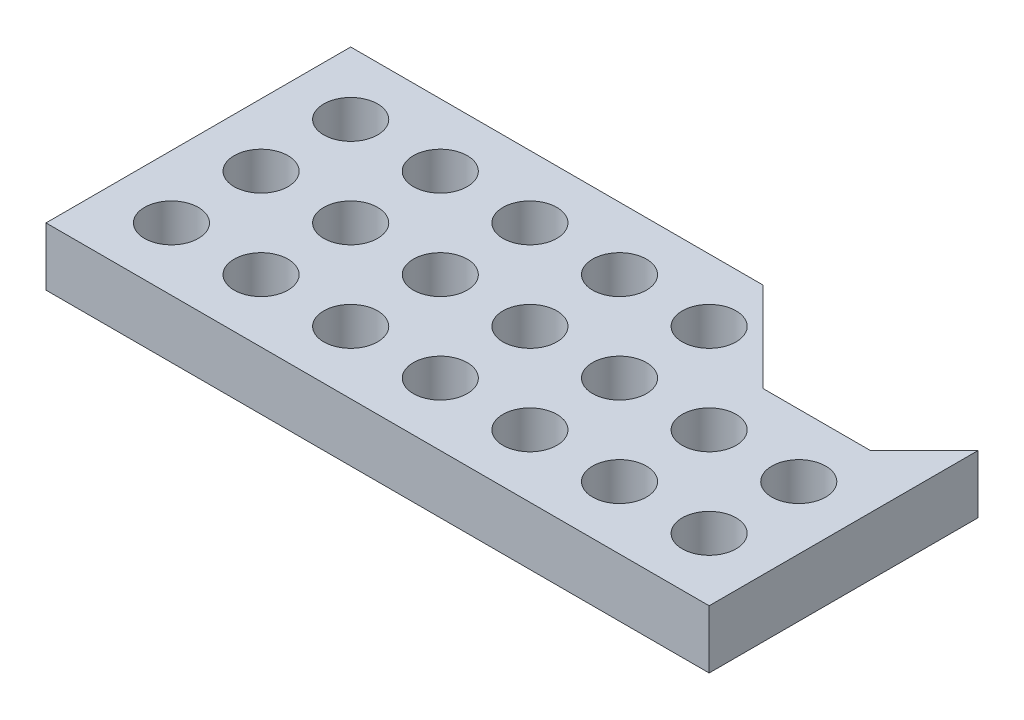
ISO-10303-21;
HEADER;
FILE_DESCRIPTION(('STEP AP214'),'2;1');
FILE_NAME('part.step','',(''),(''),'','','');
FILE_SCHEMA(('AUTOMOTIVE_DESIGN { 1 0 10303 214 1 1 1 1 }'));
ENDSEC;
DATA;
#1=APPLICATION_CONTEXT('core data for automotive mechanical design processes');
#2=APPLICATION_PROTOCOL_DEFINITION('international standard','automotive_design',2000,#1);
#3=PRODUCT_CONTEXT('',#1,'mechanical');
#4=PRODUCT('Part','Part','',(#3));
#5=PRODUCT_RELATED_PRODUCT_CATEGORY('part','',(#4));
#6=PRODUCT_DEFINITION_FORMATION('','',#4);
#7=PRODUCT_DEFINITION_CONTEXT('part definition',#1,'design');
#8=PRODUCT_DEFINITION('design','',#6,#7);
#9=PRODUCT_DEFINITION_SHAPE('','',#8);
#10=(LENGTH_UNIT() NAMED_UNIT(*) SI_UNIT(.MILLI.,.METRE.));
#11=(NAMED_UNIT(*) PLANE_ANGLE_UNIT() SI_UNIT($,.RADIAN.));
#12=(NAMED_UNIT(*) SI_UNIT($,.STERADIAN.) SOLID_ANGLE_UNIT());
#13=UNCERTAINTY_MEASURE_WITH_UNIT(LENGTH_MEASURE(1.E-05),#10,'distance_accuracy_value','');
#14=(GEOMETRIC_REPRESENTATION_CONTEXT(3) GLOBAL_UNCERTAINTY_ASSIGNED_CONTEXT((#13)) GLOBAL_UNIT_ASSIGNED_CONTEXT((#10,
#11,#12)) REPRESENTATION_CONTEXT('',''));
#15=CARTESIAN_POINT('',(0.,0.,0.));
#16=DIRECTION('',(0.,0.,1.));
#17=DIRECTION('',(1.,0.,0.));
#18=AXIS2_PLACEMENT_3D('',#15,#16,#17);
#19=CARTESIAN_POINT('',(0.,3.25,0.));
#20=DIRECTION('',(0.,1.,0.));
#21=DIRECTION('',(0.,0.,1.));
#22=AXIS2_PLACEMENT_3D('',#19,#20,#21);
#23=PLANE('',#22);
#24=CARTESIAN_POINT('',(-15.,3.25,0.));
#25=DIRECTION('',(0.,1.,0.));
#26=DIRECTION('',(0.,0.,1.));
#27=AXIS2_PLACEMENT_3D('',#24,#25,#26);
#28=CIRCLE('',#27,1.5025);
#29=CARTESIAN_POINT('',(-15.,3.25,1.50250000000001));
#30=VERTEX_POINT('',#29);
#31=EDGE_CURVE('E261',#30,#30,#28,.T.);
#32=ORIENTED_EDGE('',*,*,#31,.F.);
#33=EDGE_LOOP('',(#32));
#34=FACE_BOUND('',#33,.T.);
#35=CARTESIAN_POINT('',(0.,3.25,-4.99999999999999));
#36=DIRECTION('',(0.,1.,0.));
#37=DIRECTION('',(0.,0.,1.));
#38=AXIS2_PLACEMENT_3D('',#35,#36,#37);
#39=CIRCLE('',#38,1.5025);
#40=CARTESIAN_POINT('',(0.,3.25,-3.49749999999999));
#41=VERTEX_POINT('',#40);
#42=EDGE_CURVE('E249',#41,#41,#39,.T.);
#43=ORIENTED_EDGE('',*,*,#42,.F.);
#44=EDGE_LOOP('',(#43));
#45=FACE_BOUND('',#44,.T.);
#46=CARTESIAN_POINT('',(-10.,3.25,-4.99999999999999));
#47=DIRECTION('',(0.,1.,0.));
#48=DIRECTION('',(0.,0.,1.));
#49=AXIS2_PLACEMENT_3D('',#46,#47,#48);
#50=CIRCLE('',#49,1.5025);
#51=CARTESIAN_POINT('',(-10.,3.25,-3.49749999999999));
#52=VERTEX_POINT('',#51);
#53=EDGE_CURVE('E237',#52,#52,#50,.T.);
#54=ORIENTED_EDGE('',*,*,#53,.F.);
#55=EDGE_LOOP('',(#54));
#56=FACE_BOUND('',#55,.T.);
#57=CARTESIAN_POINT('',(9.99999999999999,3.25,0.));
#58=DIRECTION('',(0.,1.,0.));
#59=DIRECTION('',(0.,0.,1.));
#60=AXIS2_PLACEMENT_3D('',#57,#58,#59);
#61=CIRCLE('',#60,1.5025);
#62=CARTESIAN_POINT('',(9.99999999999999,3.25,1.50250000000001));
#63=VERTEX_POINT('',#62);
#64=EDGE_CURVE('E225',#63,#63,#61,.T.);
#65=ORIENTED_EDGE('',*,*,#64,.F.);
#66=EDGE_LOOP('',(#65));
#67=FACE_BOUND('',#66,.T.);
#68=CARTESIAN_POINT('',(0.,3.25,0.));
#69=DIRECTION('',(0.,1.,0.));
#70=DIRECTION('',(0.,0.,1.));
#71=AXIS2_PLACEMENT_3D('',#68,#69,#70);
#72=CIRCLE('',#71,1.5025);
#73=CARTESIAN_POINT('',(0.,3.25,1.50250000000001));
#74=VERTEX_POINT('',#73);
#75=EDGE_CURVE('E213',#74,#74,#72,.T.);
#76=ORIENTED_EDGE('',*,*,#75,.F.);
#77=EDGE_LOOP('',(#76));
#78=FACE_BOUND('',#77,.T.);
#79=CARTESIAN_POINT('',(-10.,3.25,0.));
#80=DIRECTION('',(0.,1.,0.));
#81=DIRECTION('',(0.,0.,1.));
#82=AXIS2_PLACEMENT_3D('',#79,#80,#81);
#83=CIRCLE('',#82,1.5025);
#84=CARTESIAN_POINT('',(-10.,3.25,1.50250000000001));
#85=VERTEX_POINT('',#84);
#86=EDGE_CURVE('E201',#85,#85,#83,.T.);
#87=ORIENTED_EDGE('',*,*,#86,.F.);
#88=EDGE_LOOP('',(#87));
#89=FACE_BOUND('',#88,.T.);
#90=CARTESIAN_POINT('',(10.,3.25,5.00000000000001));
#91=DIRECTION('',(0.,1.,0.));
#92=DIRECTION('',(0.,0.,1.));
#93=AXIS2_PLACEMENT_3D('',#90,#91,#92);
#94=CIRCLE('',#93,1.5025);
#95=CARTESIAN_POINT('',(10.,3.25,6.50250000000001));
#96=VERTEX_POINT('',#95);
#97=EDGE_CURVE('E189',#96,#96,#94,.T.);
#98=ORIENTED_EDGE('',*,*,#97,.F.);
#99=EDGE_LOOP('',(#98));
#100=FACE_BOUND('',#99,.T.);
#101=CARTESIAN_POINT('',(0.,3.25,5.00000000000001));
#102=DIRECTION('',(0.,1.,0.));
#103=DIRECTION('',(0.,0.,1.));
#104=AXIS2_PLACEMENT_3D('',#101,#102,#103);
#105=CIRCLE('',#104,1.5025);
#106=CARTESIAN_POINT('',(0.,3.25,6.50250000000001));
#107=VERTEX_POINT('',#106);
#108=EDGE_CURVE('E177',#107,#107,#105,.T.);
#109=ORIENTED_EDGE('',*,*,#108,.F.);
#110=EDGE_LOOP('',(#109));
#111=FACE_BOUND('',#110,.T.);
#112=CARTESIAN_POINT('',(-10.,3.25,5.00000000000001));
#113=DIRECTION('',(0.,1.,0.));
#114=DIRECTION('',(0.,0.,1.));
#115=AXIS2_PLACEMENT_3D('',#112,#113,#114);
#116=CIRCLE('',#115,1.5025);
#117=CARTESIAN_POINT('',(-10.,3.25,6.50250000000001));
#118=VERTEX_POINT('',#117);
#119=EDGE_CURVE('E165',#118,#118,#116,.T.);
#120=ORIENTED_EDGE('',*,*,#119,.F.);
#121=EDGE_LOOP('',(#120));
#122=FACE_BOUND('',#121,.T.);
#123=DIRECTION('',(0.,0.,1.));
#124=VECTOR('',#123,1.);
#125=CARTESIAN_POINT('',(-18.5,3.25,-8.49999999999999));
#126=LINE('',#125,#124);
#127=CARTESIAN_POINT('',(-18.5,3.25,-8.49999999999999));
#128=VERTEX_POINT('',#127);
#129=CARTESIAN_POINT('',(-18.5,3.25,8.50000000000001));
#130=VERTEX_POINT('',#129);
#131=EDGE_CURVE('E138',#128,#130,#126,.T.);
#132=ORIENTED_EDGE('',*,*,#131,.T.);
#133=DIRECTION('',(1.,0.,0.));
#134=VECTOR('',#133,1.);
#135=CARTESIAN_POINT('',(-18.5,3.25,8.50000000000001));
#136=LINE('',#135,#134);
#137=CARTESIAN_POINT('',(18.5,3.25,8.50000000000001));
#138=VERTEX_POINT('',#137);
#139=EDGE_CURVE('E91',#130,#138,#136,.T.);
#140=ORIENTED_EDGE('',*,*,#139,.T.);
#141=DIRECTION('',(0.,0.,-1.));
#142=VECTOR('',#141,1.);
#143=CARTESIAN_POINT('',(18.5,3.25,-6.49999999999999));
#144=LINE('',#143,#142);
#145=CARTESIAN_POINT('',(18.5,3.25,-6.49999999999999));
#146=VERTEX_POINT('',#145);
#147=EDGE_CURVE('E150',#138,#146,#144,.T.);
#148=ORIENTED_EDGE('',*,*,#147,.T.);
#149=DIRECTION('',(-0.707106781186548,0.,0.707106781186547));
#150=VECTOR('',#149,1.);
#151=CARTESIAN_POINT('',(15.5,3.25,-3.49999999999999));
#152=LINE('',#151,#150);
#153=CARTESIAN_POINT('',(15.5,3.25,-3.49999999999999));
#154=VERTEX_POINT('',#153);
#155=EDGE_CURVE('E107',#146,#154,#152,.T.);
#156=ORIENTED_EDGE('',*,*,#155,.T.);
#157=DIRECTION('',(-1.,0.,0.));
#158=VECTOR('',#157,1.);
#159=CARTESIAN_POINT('',(9.5,3.25,-3.49999999999999));
#160=LINE('',#159,#158);
#161=CARTESIAN_POINT('',(9.5,3.25,-3.49999999999999));
#162=VERTEX_POINT('',#161);
#163=EDGE_CURVE('E101',#154,#162,#160,.T.);
#164=ORIENTED_EDGE('',*,*,#163,.T.);
#165=DIRECTION('',(-0.707106781186547,0.,-0.707106781186548));
#166=VECTOR('',#165,1.);
#167=CARTESIAN_POINT('',(4.5,3.25,-8.49999999999999));
#168=LINE('',#167,#166);
#169=CARTESIAN_POINT('',(4.5,3.25,-8.49999999999999));
#170=VERTEX_POINT('',#169);
#171=EDGE_CURVE('E105',#162,#170,#168,.T.);
#172=ORIENTED_EDGE('',*,*,#171,.T.);
#173=DIRECTION('',(-1.,0.,0.));
#174=VECTOR('',#173,1.);
#175=CARTESIAN_POINT('',(-18.5,3.25,-8.49999999999999));
#176=LINE('',#175,#174);
#177=EDGE_CURVE('E51',#170,#128,#176,.T.);
#178=ORIENTED_EDGE('',*,*,#177,.T.);
#179=EDGE_LOOP('',(#132,#140,#148,#156,#164,#172,#178));
#180=FACE_BOUND('',#179,.T.);
#181=CARTESIAN_POINT('',(-15.,3.25,5.00000000000001));
#182=DIRECTION('',(0.,1.,0.));
#183=DIRECTION('',(0.,0.,1.));
#184=AXIS2_PLACEMENT_3D('',#181,#182,#183);
#185=CIRCLE('',#184,1.5025);
#186=CARTESIAN_POINT('',(-15.,3.25,6.50250000000001));
#187=VERTEX_POINT('',#186);
#188=EDGE_CURVE('E129',#187,#187,#185,.T.);
#189=ORIENTED_EDGE('',*,*,#188,.F.);
#190=EDGE_LOOP('',(#189));
#191=FACE_BOUND('',#190,.T.);
#192=CARTESIAN_POINT('',(-5.,3.25,5.00000000000001));
#193=DIRECTION('',(0.,1.,0.));
#194=DIRECTION('',(0.,0.,1.));
#195=AXIS2_PLACEMENT_3D('',#192,#193,#194);
#196=CIRCLE('',#195,1.5025);
#197=CARTESIAN_POINT('',(-5.,3.25,6.50250000000001));
#198=VERTEX_POINT('',#197);
#199=EDGE_CURVE('E171',#198,#198,#196,.T.);
#200=ORIENTED_EDGE('',*,*,#199,.F.);
#201=EDGE_LOOP('',(#200));
#202=FACE_BOUND('',#201,.T.);
#203=CARTESIAN_POINT('',(5.,3.25,5.00000000000001));
#204=DIRECTION('',(0.,1.,0.));
#205=DIRECTION('',(0.,0.,1.));
#206=AXIS2_PLACEMENT_3D('',#203,#204,#205);
#207=CIRCLE('',#206,1.5025);
#208=CARTESIAN_POINT('',(5.,3.25,6.50250000000001));
#209=VERTEX_POINT('',#208);
#210=EDGE_CURVE('E183',#209,#209,#207,.T.);
#211=ORIENTED_EDGE('',*,*,#210,.F.);
#212=EDGE_LOOP('',(#211));
#213=FACE_BOUND('',#212,.T.);
#214=CARTESIAN_POINT('',(15.,3.25,5.00000000000001));
#215=DIRECTION('',(0.,1.,0.));
#216=DIRECTION('',(0.,0.,1.));
#217=AXIS2_PLACEMENT_3D('',#214,#215,#216);
#218=CIRCLE('',#217,1.5025);
#219=CARTESIAN_POINT('',(15.,3.25,6.50250000000001));
#220=VERTEX_POINT('',#219);
#221=EDGE_CURVE('E195',#220,#220,#218,.T.);
#222=ORIENTED_EDGE('',*,*,#221,.F.);
#223=EDGE_LOOP('',(#222));
#224=FACE_BOUND('',#223,.T.);
#225=CARTESIAN_POINT('',(-5.00000000000002,3.25,0.));
#226=DIRECTION('',(0.,1.,0.));
#227=DIRECTION('',(0.,0.,1.));
#228=AXIS2_PLACEMENT_3D('',#225,#226,#227);
#229=CIRCLE('',#228,1.5025);
#230=CARTESIAN_POINT('',(-5.00000000000002,3.25,1.50250000000001));
#231=VERTEX_POINT('',#230);
#232=EDGE_CURVE('E207',#231,#231,#229,.T.);
#233=ORIENTED_EDGE('',*,*,#232,.F.);
#234=EDGE_LOOP('',(#233));
#235=FACE_BOUND('',#234,.T.);
#236=CARTESIAN_POINT('',(4.99999999999999,3.25,0.));
#237=DIRECTION('',(0.,1.,0.));
#238=DIRECTION('',(0.,0.,1.));
#239=AXIS2_PLACEMENT_3D('',#236,#237,#238);
#240=CIRCLE('',#239,1.5025);
#241=CARTESIAN_POINT('',(4.99999999999999,3.25,1.50250000000001));
#242=VERTEX_POINT('',#241);
#243=EDGE_CURVE('E219',#242,#242,#240,.T.);
#244=ORIENTED_EDGE('',*,*,#243,.F.);
#245=EDGE_LOOP('',(#244));
#246=FACE_BOUND('',#245,.T.);
#247=CARTESIAN_POINT('',(15.,3.25,0.));
#248=DIRECTION('',(0.,1.,0.));
#249=DIRECTION('',(0.,0.,1.));
#250=AXIS2_PLACEMENT_3D('',#247,#248,#249);
#251=CIRCLE('',#250,1.5025);
#252=CARTESIAN_POINT('',(15.,3.25,1.50250000000001));
#253=VERTEX_POINT('',#252);
#254=EDGE_CURVE('E231',#253,#253,#251,.T.);
#255=ORIENTED_EDGE('',*,*,#254,.F.);
#256=EDGE_LOOP('',(#255));
#257=FACE_BOUND('',#256,.T.);
#258=CARTESIAN_POINT('',(-5.00000000000003,3.25,-4.99999999999999));
#259=DIRECTION('',(0.,1.,0.));
#260=DIRECTION('',(0.,0.,1.));
#261=AXIS2_PLACEMENT_3D('',#258,#259,#260);
#262=CIRCLE('',#261,1.5025);
#263=CARTESIAN_POINT('',(-5.00000000000003,3.25,-3.49749999999999));
#264=VERTEX_POINT('',#263);
#265=EDGE_CURVE('E243',#264,#264,#262,.T.);
#266=ORIENTED_EDGE('',*,*,#265,.F.);
#267=EDGE_LOOP('',(#266));
#268=FACE_BOUND('',#267,.T.);
#269=CARTESIAN_POINT('',(4.99999999999997,3.25,-4.99999999999999));
#270=DIRECTION('',(0.,1.,0.));
#271=DIRECTION('',(0.,0.,1.));
#272=AXIS2_PLACEMENT_3D('',#269,#270,#271);
#273=CIRCLE('',#272,1.5025);
#274=CARTESIAN_POINT('',(4.99999999999997,3.25,-3.49749999999999));
#275=VERTEX_POINT('',#274);
#276=EDGE_CURVE('E255',#275,#275,#273,.T.);
#277=ORIENTED_EDGE('',*,*,#276,.F.);
#278=EDGE_LOOP('',(#277));
#279=FACE_BOUND('',#278,.T.);
#280=CARTESIAN_POINT('',(-15.,3.25,-4.99999999999999));
#281=DIRECTION('',(0.,1.,0.));
#282=DIRECTION('',(0.,0.,1.));
#283=AXIS2_PLACEMENT_3D('',#280,#281,#282);
#284=CIRCLE('',#283,1.5025);
#285=CARTESIAN_POINT('',(-15.,3.25,-3.49749999999999));
#286=VERTEX_POINT('',#285);
#287=EDGE_CURVE('E267',#286,#286,#284,.T.);
#288=ORIENTED_EDGE('',*,*,#287,.F.);
#289=EDGE_LOOP('',(#288));
#290=FACE_BOUND('',#289,.T.);
#291=ADVANCED_FACE('F34',(#34,#45,#56,#67,#78,#89,#100,#111,#122,#180,#191,#202,#213,#224,#235,
#246,#257,#268,#279,#290),#23,.T.);
#292=CARTESIAN_POINT('',(0.,0.,0.));
#293=DIRECTION('',(0.,1.,0.));
#294=DIRECTION('',(0.,0.,1.));
#295=AXIS2_PLACEMENT_3D('',#292,#293,#294);
#296=PLANE('',#295);
#297=DIRECTION('',(0.,0.,1.));
#298=VECTOR('',#297,1.);
#299=CARTESIAN_POINT('',(-18.5,0.,-8.49999999999999));
#300=LINE('',#299,#298);
#301=CARTESIAN_POINT('',(-18.5,0.,-8.49999999999999));
#302=VERTEX_POINT('',#301);
#303=CARTESIAN_POINT('',(-18.5,0.,8.50000000000001));
#304=VERTEX_POINT('',#303);
#305=EDGE_CURVE('E125',#302,#304,#300,.T.);
#306=ORIENTED_EDGE('',*,*,#305,.F.);
#307=DIRECTION('',(-1.,0.,0.));
#308=VECTOR('',#307,1.);
#309=CARTESIAN_POINT('',(-18.5,0.,-8.49999999999999));
#310=LINE('',#309,#308);
#311=CARTESIAN_POINT('',(4.5,0.,-8.49999999999999));
#312=VERTEX_POINT('',#311);
#313=EDGE_CURVE('E83',#312,#302,#310,.T.);
#314=ORIENTED_EDGE('',*,*,#313,.F.);
#315=DIRECTION('',(-0.707106781186547,0.,-0.707106781186548));
#316=VECTOR('',#315,1.);
#317=CARTESIAN_POINT('',(4.5,0.,-8.49999999999999));
#318=LINE('',#317,#316);
#319=CARTESIAN_POINT('',(9.5,0.,-3.49999999999999));
#320=VERTEX_POINT('',#319);
#321=EDGE_CURVE('E77',#320,#312,#318,.T.);
#322=ORIENTED_EDGE('',*,*,#321,.F.);
#323=DIRECTION('',(-1.,0.,0.));
#324=VECTOR('',#323,1.);
#325=CARTESIAN_POINT('',(9.5,0.,-3.49999999999999));
#326=LINE('',#325,#324);
#327=CARTESIAN_POINT('',(15.5,0.,-3.49999999999999));
#328=VERTEX_POINT('',#327);
#329=EDGE_CURVE('E115',#328,#320,#326,.T.);
#330=ORIENTED_EDGE('',*,*,#329,.F.);
#331=DIRECTION('',(-0.707106781186548,0.,0.707106781186547));
#332=VECTOR('',#331,1.);
#333=CARTESIAN_POINT('',(15.5,0.,-3.49999999999999));
#334=LINE('',#333,#332);
#335=CARTESIAN_POINT('',(18.5,0.,-6.49999999999999));
#336=VERTEX_POINT('',#335);
#337=EDGE_CURVE('E133',#336,#328,#334,.T.);
#338=ORIENTED_EDGE('',*,*,#337,.F.);
#339=DIRECTION('',(0.,0.,-1.));
#340=VECTOR('',#339,1.);
#341=CARTESIAN_POINT('',(18.5,0.,-6.49999999999999));
#342=LINE('',#341,#340);
#343=CARTESIAN_POINT('',(18.5,0.,8.50000000000001));
#344=VERTEX_POINT('',#343);
#345=EDGE_CURVE('E131',#344,#336,#342,.T.);
#346=ORIENTED_EDGE('',*,*,#345,.F.);
#347=DIRECTION('',(1.,0.,0.));
#348=VECTOR('',#347,1.);
#349=CARTESIAN_POINT('',(-18.5,0.,8.50000000000001));
#350=LINE('',#349,#348);
#351=EDGE_CURVE('E128',#304,#344,#350,.T.);
#352=ORIENTED_EDGE('',*,*,#351,.F.);
#353=EDGE_LOOP('',(#306,#314,#322,#330,#338,#346,#352));
#354=FACE_BOUND('',#353,.T.);
#355=CARTESIAN_POINT('',(-15.,0.,5.00000000000001));
#356=DIRECTION('',(0.,1.,0.));
#357=DIRECTION('',(0.,0.,1.));
#358=AXIS2_PLACEMENT_3D('',#355,#356,#357);
#359=CIRCLE('',#358,1.5025);
#360=CARTESIAN_POINT('',(-15.,0.,6.50250000000001));
#361=VERTEX_POINT('',#360);
#362=EDGE_CURVE('E162',#361,#361,#359,.T.);
#363=ORIENTED_EDGE('',*,*,#362,.T.);
#364=EDGE_LOOP('',(#363));
#365=FACE_BOUND('',#364,.T.);
#366=CARTESIAN_POINT('',(-10.,0.,5.00000000000001));
#367=DIRECTION('',(0.,1.,0.));
#368=DIRECTION('',(0.,0.,1.));
#369=AXIS2_PLACEMENT_3D('',#366,#367,#368);
#370=CIRCLE('',#369,1.5025);
#371=CARTESIAN_POINT('',(-10.,0.,6.50250000000001));
#372=VERTEX_POINT('',#371);
#373=EDGE_CURVE('E168',#372,#372,#370,.T.);
#374=ORIENTED_EDGE('',*,*,#373,.T.);
#375=EDGE_LOOP('',(#374));
#376=FACE_BOUND('',#375,.T.);
#377=CARTESIAN_POINT('',(-5.,0.,5.00000000000001));
#378=DIRECTION('',(0.,1.,0.));
#379=DIRECTION('',(0.,0.,1.));
#380=AXIS2_PLACEMENT_3D('',#377,#378,#379);
#381=CIRCLE('',#380,1.5025);
#382=CARTESIAN_POINT('',(-5.,0.,6.50250000000001));
#383=VERTEX_POINT('',#382);
#384=EDGE_CURVE('E174',#383,#383,#381,.T.);
#385=ORIENTED_EDGE('',*,*,#384,.T.);
#386=EDGE_LOOP('',(#385));
#387=FACE_BOUND('',#386,.T.);
#388=CARTESIAN_POINT('',(0.,0.,5.00000000000001));
#389=DIRECTION('',(0.,1.,0.));
#390=DIRECTION('',(0.,0.,1.));
#391=AXIS2_PLACEMENT_3D('',#388,#389,#390);
#392=CIRCLE('',#391,1.5025);
#393=CARTESIAN_POINT('',(0.,0.,6.50250000000001));
#394=VERTEX_POINT('',#393);
#395=EDGE_CURVE('E180',#394,#394,#392,.T.);
#396=ORIENTED_EDGE('',*,*,#395,.T.);
#397=EDGE_LOOP('',(#396));
#398=FACE_BOUND('',#397,.T.);
#399=CARTESIAN_POINT('',(5.,0.,5.00000000000001));
#400=DIRECTION('',(0.,1.,0.));
#401=DIRECTION('',(0.,0.,1.));
#402=AXIS2_PLACEMENT_3D('',#399,#400,#401);
#403=CIRCLE('',#402,1.5025);
#404=CARTESIAN_POINT('',(5.,0.,6.50250000000001));
#405=VERTEX_POINT('',#404);
#406=EDGE_CURVE('E186',#405,#405,#403,.T.);
#407=ORIENTED_EDGE('',*,*,#406,.T.);
#408=EDGE_LOOP('',(#407));
#409=FACE_BOUND('',#408,.T.);
#410=CARTESIAN_POINT('',(10.,0.,5.00000000000001));
#411=DIRECTION('',(0.,1.,0.));
#412=DIRECTION('',(0.,0.,1.));
#413=AXIS2_PLACEMENT_3D('',#410,#411,#412);
#414=CIRCLE('',#413,1.5025);
#415=CARTESIAN_POINT('',(10.,0.,6.50250000000001));
#416=VERTEX_POINT('',#415);
#417=EDGE_CURVE('E192',#416,#416,#414,.T.);
#418=ORIENTED_EDGE('',*,*,#417,.T.);
#419=EDGE_LOOP('',(#418));
#420=FACE_BOUND('',#419,.T.);
#421=CARTESIAN_POINT('',(15.,0.,5.00000000000001));
#422=DIRECTION('',(0.,1.,0.));
#423=DIRECTION('',(0.,0.,1.));
#424=AXIS2_PLACEMENT_3D('',#421,#422,#423);
#425=CIRCLE('',#424,1.5025);
#426=CARTESIAN_POINT('',(15.,0.,6.50250000000001));
#427=VERTEX_POINT('',#426);
#428=EDGE_CURVE('E198',#427,#427,#425,.T.);
#429=ORIENTED_EDGE('',*,*,#428,.T.);
#430=EDGE_LOOP('',(#429));
#431=FACE_BOUND('',#430,.T.);
#432=CARTESIAN_POINT('',(-10.,0.,0.));
#433=DIRECTION('',(0.,1.,0.));
#434=DIRECTION('',(0.,0.,1.));
#435=AXIS2_PLACEMENT_3D('',#432,#433,#434);
#436=CIRCLE('',#435,1.5025);
#437=CARTESIAN_POINT('',(-10.,0.,1.50250000000001));
#438=VERTEX_POINT('',#437);
#439=EDGE_CURVE('E204',#438,#438,#436,.T.);
#440=ORIENTED_EDGE('',*,*,#439,.T.);
#441=EDGE_LOOP('',(#440));
#442=FACE_BOUND('',#441,.T.);
#443=CARTESIAN_POINT('',(-5.00000000000002,0.,0.));
#444=DIRECTION('',(0.,1.,0.));
#445=DIRECTION('',(0.,0.,1.));
#446=AXIS2_PLACEMENT_3D('',#443,#444,#445);
#447=CIRCLE('',#446,1.5025);
#448=CARTESIAN_POINT('',(-5.00000000000002,0.,1.50250000000001));
#449=VERTEX_POINT('',#448);
#450=EDGE_CURVE('E210',#449,#449,#447,.T.);
#451=ORIENTED_EDGE('',*,*,#450,.T.);
#452=EDGE_LOOP('',(#451));
#453=FACE_BOUND('',#452,.T.);
#454=CARTESIAN_POINT('',(0.,0.,0.));
#455=DIRECTION('',(0.,1.,0.));
#456=DIRECTION('',(0.,0.,1.));
#457=AXIS2_PLACEMENT_3D('',#454,#455,#456);
#458=CIRCLE('',#457,1.5025);
#459=CARTESIAN_POINT('',(0.,0.,1.50250000000001));
#460=VERTEX_POINT('',#459);
#461=EDGE_CURVE('E216',#460,#460,#458,.T.);
#462=ORIENTED_EDGE('',*,*,#461,.T.);
#463=EDGE_LOOP('',(#462));
#464=FACE_BOUND('',#463,.T.);
#465=CARTESIAN_POINT('',(4.99999999999999,0.,0.));
#466=DIRECTION('',(0.,1.,0.));
#467=DIRECTION('',(0.,0.,1.));
#468=AXIS2_PLACEMENT_3D('',#465,#466,#467);
#469=CIRCLE('',#468,1.5025);
#470=CARTESIAN_POINT('',(4.99999999999999,0.,1.50250000000001));
#471=VERTEX_POINT('',#470);
#472=EDGE_CURVE('E222',#471,#471,#469,.T.);
#473=ORIENTED_EDGE('',*,*,#472,.T.);
#474=EDGE_LOOP('',(#473));
#475=FACE_BOUND('',#474,.T.);
#476=CARTESIAN_POINT('',(9.99999999999999,0.,0.));
#477=DIRECTION('',(0.,1.,0.));
#478=DIRECTION('',(0.,0.,1.));
#479=AXIS2_PLACEMENT_3D('',#476,#477,#478);
#480=CIRCLE('',#479,1.5025);
#481=CARTESIAN_POINT('',(9.99999999999999,0.,1.50250000000001));
#482=VERTEX_POINT('',#481);
#483=EDGE_CURVE('E228',#482,#482,#480,.T.);
#484=ORIENTED_EDGE('',*,*,#483,.T.);
#485=EDGE_LOOP('',(#484));
#486=FACE_BOUND('',#485,.T.);
#487=CARTESIAN_POINT('',(15.,0.,0.));
#488=DIRECTION('',(0.,1.,0.));
#489=DIRECTION('',(0.,0.,1.));
#490=AXIS2_PLACEMENT_3D('',#487,#488,#489);
#491=CIRCLE('',#490,1.5025);
#492=CARTESIAN_POINT('',(15.,0.,1.50250000000001));
#493=VERTEX_POINT('',#492);
#494=EDGE_CURVE('E234',#493,#493,#491,.T.);
#495=ORIENTED_EDGE('',*,*,#494,.T.);
#496=EDGE_LOOP('',(#495));
#497=FACE_BOUND('',#496,.T.);
#498=CARTESIAN_POINT('',(-10.,0.,-4.99999999999999));
#499=DIRECTION('',(0.,1.,0.));
#500=DIRECTION('',(0.,0.,1.));
#501=AXIS2_PLACEMENT_3D('',#498,#499,#500);
#502=CIRCLE('',#501,1.5025);
#503=CARTESIAN_POINT('',(-10.,0.,-3.49749999999999));
#504=VERTEX_POINT('',#503);
#505=EDGE_CURVE('E240',#504,#504,#502,.T.);
#506=ORIENTED_EDGE('',*,*,#505,.T.);
#507=EDGE_LOOP('',(#506));
#508=FACE_BOUND('',#507,.T.);
#509=CARTESIAN_POINT('',(-5.00000000000003,0.,-4.99999999999999));
#510=DIRECTION('',(0.,1.,0.));
#511=DIRECTION('',(0.,0.,1.));
#512=AXIS2_PLACEMENT_3D('',#509,#510,#511);
#513=CIRCLE('',#512,1.5025);
#514=CARTESIAN_POINT('',(-5.00000000000003,0.,-3.49749999999999));
#515=VERTEX_POINT('',#514);
#516=EDGE_CURVE('E246',#515,#515,#513,.T.);
#517=ORIENTED_EDGE('',*,*,#516,.T.);
#518=EDGE_LOOP('',(#517));
#519=FACE_BOUND('',#518,.T.);
#520=CARTESIAN_POINT('',(0.,0.,-4.99999999999999));
#521=DIRECTION('',(0.,1.,0.));
#522=DIRECTION('',(0.,0.,1.));
#523=AXIS2_PLACEMENT_3D('',#520,#521,#522);
#524=CIRCLE('',#523,1.5025);
#525=CARTESIAN_POINT('',(0.,0.,-3.49749999999999));
#526=VERTEX_POINT('',#525);
#527=EDGE_CURVE('E252',#526,#526,#524,.T.);
#528=ORIENTED_EDGE('',*,*,#527,.T.);
#529=EDGE_LOOP('',(#528));
#530=FACE_BOUND('',#529,.T.);
#531=CARTESIAN_POINT('',(4.99999999999997,0.,-4.99999999999999));
#532=DIRECTION('',(0.,1.,0.));
#533=DIRECTION('',(0.,0.,1.));
#534=AXIS2_PLACEMENT_3D('',#531,#532,#533);
#535=CIRCLE('',#534,1.5025);
#536=CARTESIAN_POINT('',(4.99999999999997,0.,-3.49749999999999));
#537=VERTEX_POINT('',#536);
#538=EDGE_CURVE('E258',#537,#537,#535,.T.);
#539=ORIENTED_EDGE('',*,*,#538,.T.);
#540=EDGE_LOOP('',(#539));
#541=FACE_BOUND('',#540,.T.);
#542=CARTESIAN_POINT('',(-15.,0.,0.));
#543=DIRECTION('',(0.,1.,0.));
#544=DIRECTION('',(0.,0.,1.));
#545=AXIS2_PLACEMENT_3D('',#542,#543,#544);
#546=CIRCLE('',#545,1.5025);
#547=CARTESIAN_POINT('',(-15.,0.,1.50250000000001));
#548=VERTEX_POINT('',#547);
#549=EDGE_CURVE('E264',#548,#548,#546,.T.);
#550=ORIENTED_EDGE('',*,*,#549,.T.);
#551=EDGE_LOOP('',(#550));
#552=FACE_BOUND('',#551,.T.);
#553=CARTESIAN_POINT('',(-15.,0.,-4.99999999999999));
#554=DIRECTION('',(0.,1.,0.));
#555=DIRECTION('',(0.,0.,1.));
#556=AXIS2_PLACEMENT_3D('',#553,#554,#555);
#557=CIRCLE('',#556,1.5025);
#558=CARTESIAN_POINT('',(-15.,0.,-3.49749999999999));
#559=VERTEX_POINT('',#558);
#560=EDGE_CURVE('E270',#559,#559,#557,.T.);
#561=ORIENTED_EDGE('',*,*,#560,.T.);
#562=EDGE_LOOP('',(#561));
#563=FACE_BOUND('',#562,.T.);
#564=ADVANCED_FACE('F154',(#354,#365,#376,#387,#398,#409,#420,#431,#442,#453,#464,#475,#486,
#497,#508,#519,#530,#541,#552,#563),#296,.F.);
#565=CARTESIAN_POINT('',(-18.5,3.25,-8.49999999999999));
#566=DIRECTION('',(1.,0.,0.));
#567=DIRECTION('',(0.,0.,-1.));
#568=AXIS2_PLACEMENT_3D('',#565,#566,#567);
#569=PLANE('',#568);
#570=ORIENTED_EDGE('',*,*,#305,.T.);
#571=DIRECTION('',(0.,-1.,0.));
#572=VECTOR('',#571,1.);
#573=CARTESIAN_POINT('',(-18.5,3.25,8.50000000000001));
#574=LINE('',#573,#572);
#575=EDGE_CURVE('E11',#130,#304,#574,.T.);
#576=ORIENTED_EDGE('',*,*,#575,.F.);
#577=ORIENTED_EDGE('',*,*,#131,.F.);
#578=DIRECTION('',(0.,-1.,0.));
#579=VECTOR('',#578,1.);
#580=CARTESIAN_POINT('',(-18.5,3.25,-8.49999999999999));
#581=LINE('',#580,#579);
#582=EDGE_CURVE('E121',#128,#302,#581,.T.);
#583=ORIENTED_EDGE('',*,*,#582,.T.);
#584=EDGE_LOOP('',(#570,#576,#577,#583));
#585=FACE_BOUND('',#584,.T.);
#586=ADVANCED_FACE('F36',(#585),#569,.F.);
#587=CARTESIAN_POINT('',(-18.5,3.25,8.50000000000001));
#588=DIRECTION('',(0.,0.,-1.));
#589=DIRECTION('',(-1.,0.,0.));
#590=AXIS2_PLACEMENT_3D('',#587,#588,#589);
#591=PLANE('',#590);
#592=ORIENTED_EDGE('',*,*,#351,.T.);
#593=DIRECTION('',(0.,-1.,0.));
#594=VECTOR('',#593,1.);
#595=CARTESIAN_POINT('',(18.5,3.25,8.50000000000001));
#596=LINE('',#595,#594);
#597=EDGE_CURVE('E43',#138,#344,#596,.T.);
#598=ORIENTED_EDGE('',*,*,#597,.F.);
#599=ORIENTED_EDGE('',*,*,#139,.F.);
#600=ORIENTED_EDGE('',*,*,#575,.T.);
#601=EDGE_LOOP('',(#592,#598,#599,#600));
#602=FACE_BOUND('',#601,.T.);
#603=ADVANCED_FACE('F302',(#602),#591,.F.);
#604=CARTESIAN_POINT('',(18.5,3.25,-6.49999999999999));
#605=DIRECTION('',(-1.,0.,0.));
#606=DIRECTION('',(0.,0.,1.));
#607=AXIS2_PLACEMENT_3D('',#604,#605,#606);
#608=PLANE('',#607);
#609=ORIENTED_EDGE('',*,*,#345,.T.);
#610=DIRECTION('',(0.,-1.,0.));
#611=VECTOR('',#610,1.);
#612=CARTESIAN_POINT('',(18.5,3.25,-6.49999999999999));
#613=LINE('',#612,#611);
#614=EDGE_CURVE('E142',#146,#336,#613,.T.);
#615=ORIENTED_EDGE('',*,*,#614,.F.);
#616=ORIENTED_EDGE('',*,*,#147,.F.);
#617=ORIENTED_EDGE('',*,*,#597,.T.);
#618=EDGE_LOOP('',(#609,#615,#616,#617));
#619=FACE_BOUND('',#618,.T.);
#620=ADVANCED_FACE('F148',(#619),#608,.F.);
#621=CARTESIAN_POINT('',(15.5,3.25,-3.49999999999999));
#622=DIRECTION('',(0.707106781186547,0.,0.707106781186548));
#623=DIRECTION('',(0.707106781186548,0.,-0.707106781186547));
#624=AXIS2_PLACEMENT_3D('',#621,#622,#623);
#625=PLANE('',#624);
#626=ORIENTED_EDGE('',*,*,#337,.T.);
#627=DIRECTION('',(0.,-1.,0.));
#628=VECTOR('',#627,1.);
#629=CARTESIAN_POINT('',(15.5,3.25,-3.49999999999999));
#630=LINE('',#629,#628);
#631=EDGE_CURVE('E116',#154,#328,#630,.T.);
#632=ORIENTED_EDGE('',*,*,#631,.F.);
#633=ORIENTED_EDGE('',*,*,#155,.F.);
#634=ORIENTED_EDGE('',*,*,#614,.T.);
#635=EDGE_LOOP('',(#626,#632,#633,#634));
#636=FACE_BOUND('',#635,.T.);
#637=ADVANCED_FACE('F157',(#636),#625,.F.);
#638=CARTESIAN_POINT('',(9.5,3.25,-3.49999999999999));
#639=DIRECTION('',(0.,0.,1.));
#640=DIRECTION('',(1.,0.,0.));
#641=AXIS2_PLACEMENT_3D('',#638,#639,#640);
#642=PLANE('',#641);
#643=ORIENTED_EDGE('',*,*,#329,.T.);
#644=DIRECTION('',(0.,-1.,0.));
#645=VECTOR('',#644,1.);
#646=CARTESIAN_POINT('',(9.5,3.25,-3.49999999999999));
#647=LINE('',#646,#645);
#648=EDGE_CURVE('E112',#162,#320,#647,.T.);
#649=ORIENTED_EDGE('',*,*,#648,.F.);
#650=ORIENTED_EDGE('',*,*,#163,.F.);
#651=ORIENTED_EDGE('',*,*,#631,.T.);
#652=EDGE_LOOP('',(#643,#649,#650,#651));
#653=FACE_BOUND('',#652,.T.);
#654=ADVANCED_FACE('F113',(#653),#642,.F.);
#655=CARTESIAN_POINT('',(4.5,3.25,-8.49999999999999));
#656=DIRECTION('',(-0.707106781186548,0.,0.707106781186547));
#657=DIRECTION('',(0.707106781186547,0.,0.707106781186548));
#658=AXIS2_PLACEMENT_3D('',#655,#656,#657);
#659=PLANE('',#658);
#660=ORIENTED_EDGE('',*,*,#321,.T.);
#661=DIRECTION('',(0.,-1.,0.));
#662=VECTOR('',#661,1.);
#663=CARTESIAN_POINT('',(4.5,3.25,-8.49999999999999));
#664=LINE('',#663,#662);
#665=EDGE_CURVE('E117',#170,#312,#664,.T.);
#666=ORIENTED_EDGE('',*,*,#665,.F.);
#667=ORIENTED_EDGE('',*,*,#171,.F.);
#668=ORIENTED_EDGE('',*,*,#648,.T.);
#669=EDGE_LOOP('',(#660,#666,#667,#668));
#670=FACE_BOUND('',#669,.T.);
#671=ADVANCED_FACE('F119',(#670),#659,.F.);
#672=CARTESIAN_POINT('',(-18.5,3.25,-8.49999999999999));
#673=DIRECTION('',(0.,0.,1.));
#674=DIRECTION('',(1.,0.,0.));
#675=AXIS2_PLACEMENT_3D('',#672,#673,#674);
#676=PLANE('',#675);
#677=ORIENTED_EDGE('',*,*,#313,.T.);
#678=ORIENTED_EDGE('',*,*,#582,.F.);
#679=ORIENTED_EDGE('',*,*,#177,.F.);
#680=ORIENTED_EDGE('',*,*,#665,.T.);
#681=EDGE_LOOP('',(#677,#678,#679,#680));
#682=FACE_BOUND('',#681,.T.);
#683=ADVANCED_FACE('F292',(#682),#676,.F.);
#684=CARTESIAN_POINT('',(-15.,3.25,5.00000000000001));
#685=DIRECTION('',(0.,-1.,0.));
#686=DIRECTION('',(0.,0.,-1.));
#687=AXIS2_PLACEMENT_3D('',#684,#685,#686);
#688=CYLINDRICAL_SURFACE('',#687,1.5025);
#689=ORIENTED_EDGE('',*,*,#188,.T.);
#690=EDGE_LOOP('',(#689));
#691=FACE_BOUND('',#690,.T.);
#692=ORIENTED_EDGE('',*,*,#362,.F.);
#693=EDGE_LOOP('',(#692));
#694=FACE_BOUND('',#693,.T.);
#695=ADVANCED_FACE('F289',(#691,#694),#688,.F.);
#696=CARTESIAN_POINT('',(-10.,3.25,5.00000000000001));
#697=DIRECTION('',(0.,-1.,0.));
#698=DIRECTION('',(0.,0.,-1.));
#699=AXIS2_PLACEMENT_3D('',#696,#697,#698);
#700=CYLINDRICAL_SURFACE('',#699,1.5025);
#701=ORIENTED_EDGE('',*,*,#119,.T.);
#702=EDGE_LOOP('',(#701));
#703=FACE_BOUND('',#702,.T.);
#704=ORIENTED_EDGE('',*,*,#373,.F.);
#705=EDGE_LOOP('',(#704));
#706=FACE_BOUND('',#705,.T.);
#707=ADVANCED_FACE('F361',(#703,#706),#700,.F.);
#708=CARTESIAN_POINT('',(-5.,3.25,5.00000000000001));
#709=DIRECTION('',(0.,-1.,0.));
#710=DIRECTION('',(0.,0.,-1.));
#711=AXIS2_PLACEMENT_3D('',#708,#709,#710);
#712=CYLINDRICAL_SURFACE('',#711,1.5025);
#713=ORIENTED_EDGE('',*,*,#199,.T.);
#714=EDGE_LOOP('',(#713));
#715=FACE_BOUND('',#714,.T.);
#716=ORIENTED_EDGE('',*,*,#384,.F.);
#717=EDGE_LOOP('',(#716));
#718=FACE_BOUND('',#717,.T.);
#719=ADVANCED_FACE('F369',(#715,#718),#712,.F.);
#720=CARTESIAN_POINT('',(0.,3.25,5.00000000000001));
#721=DIRECTION('',(0.,-1.,0.));
#722=DIRECTION('',(0.,0.,-1.));
#723=AXIS2_PLACEMENT_3D('',#720,#721,#722);
#724=CYLINDRICAL_SURFACE('',#723,1.5025);
#725=ORIENTED_EDGE('',*,*,#108,.T.);
#726=EDGE_LOOP('',(#725));
#727=FACE_BOUND('',#726,.T.);
#728=ORIENTED_EDGE('',*,*,#395,.F.);
#729=EDGE_LOOP('',(#728));
#730=FACE_BOUND('',#729,.T.);
#731=ADVANCED_FACE('F377',(#727,#730),#724,.F.);
#732=CARTESIAN_POINT('',(5.,3.25,5.00000000000001));
#733=DIRECTION('',(0.,-1.,0.));
#734=DIRECTION('',(0.,0.,-1.));
#735=AXIS2_PLACEMENT_3D('',#732,#733,#734);
#736=CYLINDRICAL_SURFACE('',#735,1.5025);
#737=ORIENTED_EDGE('',*,*,#210,.T.);
#738=EDGE_LOOP('',(#737));
#739=FACE_BOUND('',#738,.T.);
#740=ORIENTED_EDGE('',*,*,#406,.F.);
#741=EDGE_LOOP('',(#740));
#742=FACE_BOUND('',#741,.T.);
#743=ADVANCED_FACE('F386',(#739,#742),#736,.F.);
#744=CARTESIAN_POINT('',(10.,3.25,5.00000000000001));
#745=DIRECTION('',(0.,-1.,0.));
#746=DIRECTION('',(0.,0.,-1.));
#747=AXIS2_PLACEMENT_3D('',#744,#745,#746);
#748=CYLINDRICAL_SURFACE('',#747,1.5025);
#749=ORIENTED_EDGE('',*,*,#97,.T.);
#750=EDGE_LOOP('',(#749));
#751=FACE_BOUND('',#750,.T.);
#752=ORIENTED_EDGE('',*,*,#417,.F.);
#753=EDGE_LOOP('',(#752));
#754=FACE_BOUND('',#753,.T.);
#755=ADVANCED_FACE('F395',(#751,#754),#748,.F.);
#756=CARTESIAN_POINT('',(15.,3.25,5.00000000000001));
#757=DIRECTION('',(0.,-1.,0.));
#758=DIRECTION('',(0.,0.,-1.));
#759=AXIS2_PLACEMENT_3D('',#756,#757,#758);
#760=CYLINDRICAL_SURFACE('',#759,1.5025);
#761=ORIENTED_EDGE('',*,*,#221,.T.);
#762=EDGE_LOOP('',(#761));
#763=FACE_BOUND('',#762,.T.);
#764=ORIENTED_EDGE('',*,*,#428,.F.);
#765=EDGE_LOOP('',(#764));
#766=FACE_BOUND('',#765,.T.);
#767=ADVANCED_FACE('F404',(#763,#766),#760,.F.);
#768=CARTESIAN_POINT('',(-10.,3.25,0.));
#769=DIRECTION('',(0.,-1.,0.));
#770=DIRECTION('',(0.,0.,-1.));
#771=AXIS2_PLACEMENT_3D('',#768,#769,#770);
#772=CYLINDRICAL_SURFACE('',#771,1.5025);
#773=ORIENTED_EDGE('',*,*,#86,.T.);
#774=EDGE_LOOP('',(#773));
#775=FACE_BOUND('',#774,.T.);
#776=ORIENTED_EDGE('',*,*,#439,.F.);
#777=EDGE_LOOP('',(#776));
#778=FACE_BOUND('',#777,.T.);
#779=ADVANCED_FACE('F413',(#775,#778),#772,.F.);
#780=CARTESIAN_POINT('',(-5.00000000000002,3.25,0.));
#781=DIRECTION('',(0.,-1.,0.));
#782=DIRECTION('',(0.,0.,-1.));
#783=AXIS2_PLACEMENT_3D('',#780,#781,#782);
#784=CYLINDRICAL_SURFACE('',#783,1.5025);
#785=ORIENTED_EDGE('',*,*,#232,.T.);
#786=EDGE_LOOP('',(#785));
#787=FACE_BOUND('',#786,.T.);
#788=ORIENTED_EDGE('',*,*,#450,.F.);
#789=EDGE_LOOP('',(#788));
#790=FACE_BOUND('',#789,.T.);
#791=ADVANCED_FACE('F422',(#787,#790),#784,.F.);
#792=CARTESIAN_POINT('',(0.,3.25,0.));
#793=DIRECTION('',(0.,-1.,0.));
#794=DIRECTION('',(0.,0.,-1.));
#795=AXIS2_PLACEMENT_3D('',#792,#793,#794);
#796=CYLINDRICAL_SURFACE('',#795,1.5025);
#797=ORIENTED_EDGE('',*,*,#75,.T.);
#798=EDGE_LOOP('',(#797));
#799=FACE_BOUND('',#798,.T.);
#800=ORIENTED_EDGE('',*,*,#461,.F.);
#801=EDGE_LOOP('',(#800));
#802=FACE_BOUND('',#801,.T.);
#803=ADVANCED_FACE('F431',(#799,#802),#796,.F.);
#804=CARTESIAN_POINT('',(4.99999999999999,3.25,0.));
#805=DIRECTION('',(0.,-1.,0.));
#806=DIRECTION('',(0.,0.,-1.));
#807=AXIS2_PLACEMENT_3D('',#804,#805,#806);
#808=CYLINDRICAL_SURFACE('',#807,1.5025);
#809=ORIENTED_EDGE('',*,*,#243,.T.);
#810=EDGE_LOOP('',(#809));
#811=FACE_BOUND('',#810,.T.);
#812=ORIENTED_EDGE('',*,*,#472,.F.);
#813=EDGE_LOOP('',(#812));
#814=FACE_BOUND('',#813,.T.);
#815=ADVANCED_FACE('F440',(#811,#814),#808,.F.);
#816=CARTESIAN_POINT('',(9.99999999999999,3.25,0.));
#817=DIRECTION('',(0.,-1.,0.));
#818=DIRECTION('',(0.,0.,-1.));
#819=AXIS2_PLACEMENT_3D('',#816,#817,#818);
#820=CYLINDRICAL_SURFACE('',#819,1.5025);
#821=ORIENTED_EDGE('',*,*,#64,.T.);
#822=EDGE_LOOP('',(#821));
#823=FACE_BOUND('',#822,.T.);
#824=ORIENTED_EDGE('',*,*,#483,.F.);
#825=EDGE_LOOP('',(#824));
#826=FACE_BOUND('',#825,.T.);
#827=ADVANCED_FACE('F449',(#823,#826),#820,.F.);
#828=CARTESIAN_POINT('',(15.,3.25,0.));
#829=DIRECTION('',(0.,-1.,0.));
#830=DIRECTION('',(0.,0.,-1.));
#831=AXIS2_PLACEMENT_3D('',#828,#829,#830);
#832=CYLINDRICAL_SURFACE('',#831,1.5025);
#833=ORIENTED_EDGE('',*,*,#254,.T.);
#834=EDGE_LOOP('',(#833));
#835=FACE_BOUND('',#834,.T.);
#836=ORIENTED_EDGE('',*,*,#494,.F.);
#837=EDGE_LOOP('',(#836));
#838=FACE_BOUND('',#837,.T.);
#839=ADVANCED_FACE('F458',(#835,#838),#832,.F.);
#840=CARTESIAN_POINT('',(-10.,3.25,-4.99999999999999));
#841=DIRECTION('',(0.,-1.,0.));
#842=DIRECTION('',(0.,0.,-1.));
#843=AXIS2_PLACEMENT_3D('',#840,#841,#842);
#844=CYLINDRICAL_SURFACE('',#843,1.5025);
#845=ORIENTED_EDGE('',*,*,#53,.T.);
#846=EDGE_LOOP('',(#845));
#847=FACE_BOUND('',#846,.T.);
#848=ORIENTED_EDGE('',*,*,#505,.F.);
#849=EDGE_LOOP('',(#848));
#850=FACE_BOUND('',#849,.T.);
#851=ADVANCED_FACE('F467',(#847,#850),#844,.F.);
#852=CARTESIAN_POINT('',(-5.00000000000003,3.25,-4.99999999999999));
#853=DIRECTION('',(0.,-1.,0.));
#854=DIRECTION('',(0.,0.,-1.));
#855=AXIS2_PLACEMENT_3D('',#852,#853,#854);
#856=CYLINDRICAL_SURFACE('',#855,1.5025);
#857=ORIENTED_EDGE('',*,*,#265,.T.);
#858=EDGE_LOOP('',(#857));
#859=FACE_BOUND('',#858,.T.);
#860=ORIENTED_EDGE('',*,*,#516,.F.);
#861=EDGE_LOOP('',(#860));
#862=FACE_BOUND('',#861,.T.);
#863=ADVANCED_FACE('F476',(#859,#862),#856,.F.);
#864=CARTESIAN_POINT('',(0.,3.25,-4.99999999999999));
#865=DIRECTION('',(0.,-1.,0.));
#866=DIRECTION('',(0.,0.,-1.));
#867=AXIS2_PLACEMENT_3D('',#864,#865,#866);
#868=CYLINDRICAL_SURFACE('',#867,1.5025);
#869=ORIENTED_EDGE('',*,*,#42,.T.);
#870=EDGE_LOOP('',(#869));
#871=FACE_BOUND('',#870,.T.);
#872=ORIENTED_EDGE('',*,*,#527,.F.);
#873=EDGE_LOOP('',(#872));
#874=FACE_BOUND('',#873,.T.);
#875=ADVANCED_FACE('F485',(#871,#874),#868,.F.);
#876=CARTESIAN_POINT('',(4.99999999999997,3.25,-4.99999999999999));
#877=DIRECTION('',(0.,-1.,0.));
#878=DIRECTION('',(0.,0.,-1.));
#879=AXIS2_PLACEMENT_3D('',#876,#877,#878);
#880=CYLINDRICAL_SURFACE('',#879,1.5025);
#881=ORIENTED_EDGE('',*,*,#276,.T.);
#882=EDGE_LOOP('',(#881));
#883=FACE_BOUND('',#882,.T.);
#884=ORIENTED_EDGE('',*,*,#538,.F.);
#885=EDGE_LOOP('',(#884));
#886=FACE_BOUND('',#885,.T.);
#887=ADVANCED_FACE('F494',(#883,#886),#880,.F.);
#888=CARTESIAN_POINT('',(-15.,3.25,0.));
#889=DIRECTION('',(0.,-1.,0.));
#890=DIRECTION('',(0.,0.,-1.));
#891=AXIS2_PLACEMENT_3D('',#888,#889,#890);
#892=CYLINDRICAL_SURFACE('',#891,1.5025);
#893=ORIENTED_EDGE('',*,*,#31,.T.);
#894=EDGE_LOOP('',(#893));
#895=FACE_BOUND('',#894,.T.);
#896=ORIENTED_EDGE('',*,*,#549,.F.);
#897=EDGE_LOOP('',(#896));
#898=FACE_BOUND('',#897,.T.);
#899=ADVANCED_FACE('F503',(#895,#898),#892,.F.);
#900=CARTESIAN_POINT('',(-15.,3.25,-4.99999999999999));
#901=DIRECTION('',(0.,-1.,0.));
#902=DIRECTION('',(0.,0.,-1.));
#903=AXIS2_PLACEMENT_3D('',#900,#901,#902);
#904=CYLINDRICAL_SURFACE('',#903,1.5025);
#905=ORIENTED_EDGE('',*,*,#287,.T.);
#906=EDGE_LOOP('',(#905));
#907=FACE_BOUND('',#906,.T.);
#908=ORIENTED_EDGE('',*,*,#560,.F.);
#909=EDGE_LOOP('',(#908));
#910=FACE_BOUND('',#909,.T.);
#911=ADVANCED_FACE('F276',(#907,#910),#904,.F.);
#912=CLOSED_SHELL('',(#291,#564,#586,#603,#620,#637,#654,#671,#683,#695,#707,#719,#731,#743,
#755,#767,#779,#791,#803,#815,#827,#839,#851,#863,#875,#887,#899,#911));
#913=MANIFOLD_SOLID_BREP('B2',#912);
#914=ADVANCED_BREP_SHAPE_REPRESENTATION('',(#18,#913),#14);
#915=SHAPE_DEFINITION_REPRESENTATION(#9,#914);
ENDSEC;
END-ISO-10303-21;
